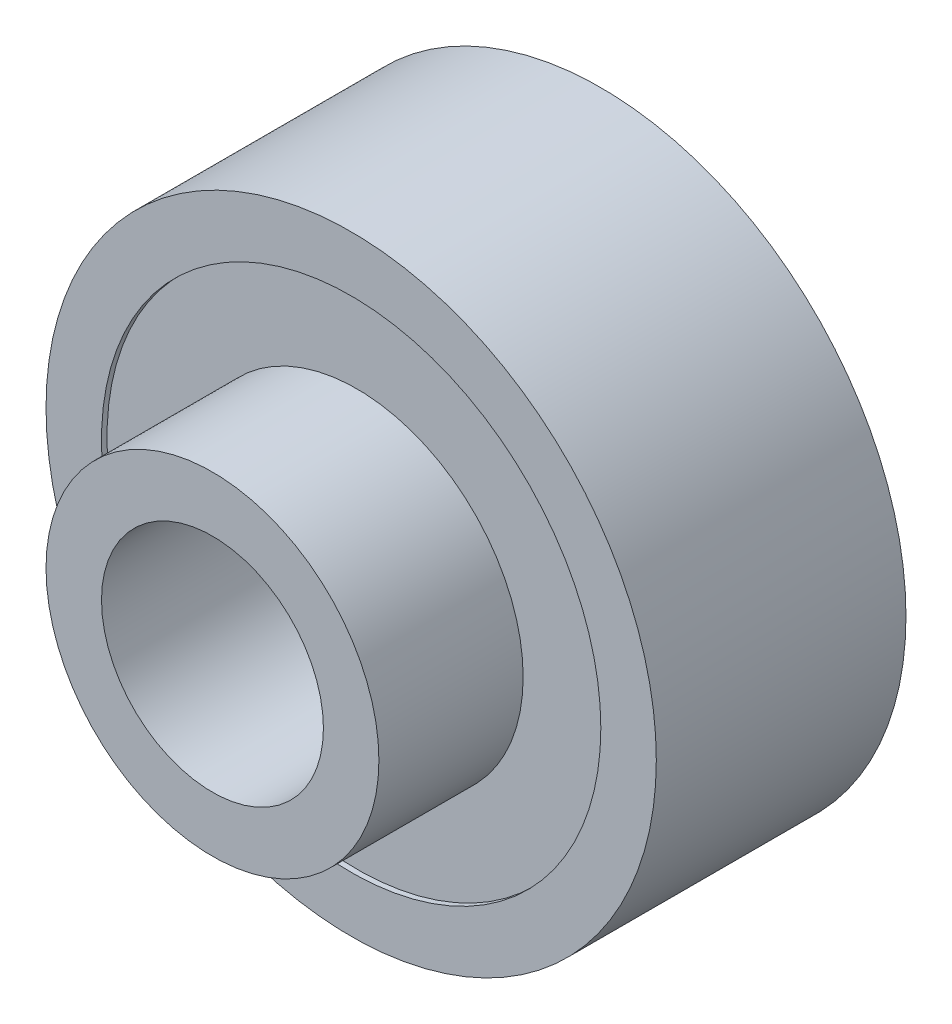
ISO-10303-21;
HEADER;
FILE_DESCRIPTION(('STEP AP214'),'2;1');
FILE_NAME('part.step','',(''),(''),'','','');
FILE_SCHEMA(('AUTOMOTIVE_DESIGN { 1 0 10303 214 1 1 1 1 }'));
ENDSEC;
DATA;
#1=APPLICATION_CONTEXT('core data for automotive mechanical design processes');
#2=APPLICATION_PROTOCOL_DEFINITION('international standard','automotive_design',2000,#1);
#3=PRODUCT_CONTEXT('',#1,'mechanical');
#4=PRODUCT('Part','Part','',(#3));
#5=PRODUCT_RELATED_PRODUCT_CATEGORY('part','',(#4));
#6=PRODUCT_DEFINITION_FORMATION('','',#4);
#7=PRODUCT_DEFINITION_CONTEXT('part definition',#1,'design');
#8=PRODUCT_DEFINITION('design','',#6,#7);
#9=PRODUCT_DEFINITION_SHAPE('','',#8);
#10=(LENGTH_UNIT() NAMED_UNIT(*) SI_UNIT(.MILLI.,.METRE.));
#11=(NAMED_UNIT(*) PLANE_ANGLE_UNIT() SI_UNIT($,.RADIAN.));
#12=(NAMED_UNIT(*) SI_UNIT($,.STERADIAN.) SOLID_ANGLE_UNIT());
#13=UNCERTAINTY_MEASURE_WITH_UNIT(LENGTH_MEASURE(1.E-05),#10,'distance_accuracy_value','');
#14=(GEOMETRIC_REPRESENTATION_CONTEXT(3) GLOBAL_UNCERTAINTY_ASSIGNED_CONTEXT((#13)) GLOBAL_UNIT_ASSIGNED_CONTEXT((#10,
#11,#12)) REPRESENTATION_CONTEXT('',''));
#15=CARTESIAN_POINT('',(0.,0.,0.));
#16=DIRECTION('',(0.,0.,1.));
#17=DIRECTION('',(1.,0.,0.));
#18=AXIS2_PLACEMENT_3D('',#15,#16,#17);
#19=CARTESIAN_POINT('',(0.,0.,0.));
#20=DIRECTION('',(0.,0.,1.));
#21=DIRECTION('',(1.,0.,0.));
#22=AXIS2_PLACEMENT_3D('',#19,#20,#21);
#23=PLANE('',#22);
#24=CARTESIAN_POINT('',(0.,0.,0.));
#25=DIRECTION('',(0.,0.,1.));
#26=DIRECTION('',(1.,0.,0.));
#27=AXIS2_PLACEMENT_3D('',#24,#25,#26);
#28=CIRCLE('',#27,4.);
#29=CARTESIAN_POINT('',(4.,0.,0.));
#30=VERTEX_POINT('',#29);
#31=EDGE_CURVE('E46',#30,#30,#28,.T.);
#32=ORIENTED_EDGE('',*,*,#31,.T.);
#33=EDGE_LOOP('',(#32));
#34=FACE_BOUND('',#33,.T.);
#35=CARTESIAN_POINT('',(0.,0.,0.));
#36=DIRECTION('',(0.,0.,-1.));
#37=DIRECTION('',(-1.,0.,0.));
#38=AXIS2_PLACEMENT_3D('',#35,#36,#37);
#39=CIRCLE('',#38,6.);
#40=CARTESIAN_POINT('',(-6.,0.,0.));
#41=VERTEX_POINT('',#40);
#42=EDGE_CURVE('E66',#41,#41,#39,.T.);
#43=ORIENTED_EDGE('',*,*,#42,.T.);
#44=EDGE_LOOP('',(#43));
#45=FACE_BOUND('',#44,.T.);
#46=ADVANCED_FACE('F35',(#34,#45),#23,.F.);
#47=CARTESIAN_POINT('',(0.,0.,9.));
#48=DIRECTION('',(0.,0.,-1.));
#49=DIRECTION('',(-1.,0.,0.));
#50=AXIS2_PLACEMENT_3D('',#47,#48,#49);
#51=CYLINDRICAL_SURFACE('',#50,11.);
#52=CARTESIAN_POINT('',(0.,0.,9.));
#53=DIRECTION('',(0.,0.,1.));
#54=DIRECTION('',(1.,0.,0.));
#55=AXIS2_PLACEMENT_3D('',#52,#53,#54);
#56=CIRCLE('',#55,11.);
#57=CARTESIAN_POINT('',(11.,0.,9.));
#58=VERTEX_POINT('',#57);
#59=EDGE_CURVE('E10',#58,#58,#56,.T.);
#60=ORIENTED_EDGE('',*,*,#59,.F.);
#61=EDGE_LOOP('',(#60));
#62=FACE_BOUND('',#61,.T.);
#63=CARTESIAN_POINT('',(0.,0.,0.));
#64=DIRECTION('',(0.,0.,1.));
#65=DIRECTION('',(1.,0.,0.));
#66=AXIS2_PLACEMENT_3D('',#63,#64,#65);
#67=CIRCLE('',#66,11.);
#68=CARTESIAN_POINT('',(11.,0.,0.));
#69=VERTEX_POINT('',#68);
#70=EDGE_CURVE('E39',#69,#69,#67,.T.);
#71=ORIENTED_EDGE('',*,*,#70,.T.);
#72=EDGE_LOOP('',(#71));
#73=FACE_BOUND('',#72,.T.);
#74=ADVANCED_FACE('F37',(#62,#73),#51,.T.);
#75=CARTESIAN_POINT('',(0.,0.,9.));
#76=DIRECTION('',(0.,0.,1.));
#77=DIRECTION('',(1.,0.,0.));
#78=AXIS2_PLACEMENT_3D('',#75,#76,#77);
#79=PLANE('',#78);
#80=CARTESIAN_POINT('',(0.,0.,9.));
#81=DIRECTION('',(0.,0.,1.));
#82=DIRECTION('',(1.,0.,0.));
#83=AXIS2_PLACEMENT_3D('',#80,#81,#82);
#84=CIRCLE('',#83,9.);
#85=CARTESIAN_POINT('',(9.,0.,9.));
#86=VERTEX_POINT('',#85);
#87=EDGE_CURVE('E51',#86,#86,#84,.T.);
#88=ORIENTED_EDGE('',*,*,#87,.F.);
#89=EDGE_LOOP('',(#88));
#90=FACE_BOUND('',#89,.T.);
#91=ORIENTED_EDGE('',*,*,#59,.T.);
#92=EDGE_LOOP('',(#91));
#93=FACE_BOUND('',#92,.T.);
#94=ADVANCED_FACE('F97',(#90,#93),#79,.T.);
#95=CARTESIAN_POINT('',(0.,0.,0.));
#96=DIRECTION('',(0.,0.,-1.));
#97=DIRECTION('',(-1.,0.,0.));
#98=AXIS2_PLACEMENT_3D('',#95,#96,#97);
#99=CIRCLE('',#98,9.);
#100=CARTESIAN_POINT('',(-9.,0.,0.));
#101=VERTEX_POINT('',#100);
#102=EDGE_CURVE('E60',#101,#101,#99,.T.);
#103=ORIENTED_EDGE('',*,*,#102,.F.);
#104=EDGE_LOOP('',(#103));
#105=FACE_BOUND('',#104,.T.);
#106=ORIENTED_EDGE('',*,*,#70,.F.);
#107=EDGE_LOOP('',(#106));
#108=FACE_BOUND('',#107,.T.);
#109=ADVANCED_FACE('F93',(#105,#108),#23,.F.);
#110=CARTESIAN_POINT('',(0.,0.,0.));
#111=DIRECTION('',(0.,0.,1.));
#112=DIRECTION('',(1.,0.,0.));
#113=AXIS2_PLACEMENT_3D('',#110,#111,#112);
#114=CYLINDRICAL_SURFACE('',#113,4.);
#115=ORIENTED_EDGE('',*,*,#31,.F.);
#116=EDGE_LOOP('',(#115));
#117=FACE_BOUND('',#116,.T.);
#118=CARTESIAN_POINT('',(0.,0.,14.));
#119=DIRECTION('',(0.,0.,1.));
#120=DIRECTION('',(1.,0.,0.));
#121=AXIS2_PLACEMENT_3D('',#118,#119,#120);
#122=CIRCLE('',#121,4.);
#123=CARTESIAN_POINT('',(4.,0.,14.));
#124=VERTEX_POINT('',#123);
#125=EDGE_CURVE('E74',#124,#124,#122,.T.);
#126=ORIENTED_EDGE('',*,*,#125,.T.);
#127=EDGE_LOOP('',(#126));
#128=FACE_BOUND('',#127,.T.);
#129=ADVANCED_FACE('F78',(#117,#128),#114,.F.);
#130=CARTESIAN_POINT('',(0.,0.,8.8));
#131=DIRECTION('',(0.,0.,1.));
#132=DIRECTION('',(1.,0.,0.));
#133=AXIS2_PLACEMENT_3D('',#130,#131,#132);
#134=CYLINDRICAL_SURFACE('',#133,9.);
#135=CARTESIAN_POINT('',(0.,0.,8.8));
#136=DIRECTION('',(0.,0.,1.));
#137=DIRECTION('',(1.,0.,0.));
#138=AXIS2_PLACEMENT_3D('',#135,#136,#137);
#139=CIRCLE('',#138,9.);
#140=CARTESIAN_POINT('',(9.,0.,8.8));
#141=VERTEX_POINT('',#140);
#142=EDGE_CURVE('E50',#141,#141,#139,.T.);
#143=ORIENTED_EDGE('',*,*,#142,.F.);
#144=EDGE_LOOP('',(#143));
#145=FACE_BOUND('',#144,.T.);
#146=ORIENTED_EDGE('',*,*,#87,.T.);
#147=EDGE_LOOP('',(#146));
#148=FACE_BOUND('',#147,.T.);
#149=ADVANCED_FACE('F107',(#145,#148),#134,.F.);
#150=CARTESIAN_POINT('',(0.,0.,8.8));
#151=DIRECTION('',(0.,0.,1.));
#152=DIRECTION('',(1.,0.,0.));
#153=AXIS2_PLACEMENT_3D('',#150,#151,#152);
#154=PLANE('',#153);
#155=CARTESIAN_POINT('',(0.,0.,8.8));
#156=DIRECTION('',(0.,0.,1.));
#157=DIRECTION('',(1.,0.,0.));
#158=AXIS2_PLACEMENT_3D('',#155,#156,#157);
#159=CIRCLE('',#158,6.);
#160=CARTESIAN_POINT('',(6.,0.,8.8));
#161=VERTEX_POINT('',#160);
#162=EDGE_CURVE('E54',#161,#161,#159,.T.);
#163=ORIENTED_EDGE('',*,*,#162,.F.);
#164=EDGE_LOOP('',(#163));
#165=FACE_BOUND('',#164,.T.);
#166=ORIENTED_EDGE('',*,*,#142,.T.);
#167=EDGE_LOOP('',(#166));
#168=FACE_BOUND('',#167,.T.);
#169=ADVANCED_FACE('F127',(#165,#168),#154,.T.);
#170=CARTESIAN_POINT('',(0.,0.,8.8));
#171=DIRECTION('',(0.,0.,1.));
#172=DIRECTION('',(1.,0.,0.));
#173=AXIS2_PLACEMENT_3D('',#170,#171,#172);
#174=CYLINDRICAL_SURFACE('',#173,6.);
#175=ORIENTED_EDGE('',*,*,#162,.T.);
#176=EDGE_LOOP('',(#175));
#177=FACE_BOUND('',#176,.T.);
#178=CARTESIAN_POINT('',(0.,0.,14.));
#179=DIRECTION('',(0.,0.,1.));
#180=DIRECTION('',(1.,0.,0.));
#181=AXIS2_PLACEMENT_3D('',#178,#179,#180);
#182=CIRCLE('',#181,6.);
#183=CARTESIAN_POINT('',(6.,0.,14.));
#184=VERTEX_POINT('',#183);
#185=EDGE_CURVE('E69',#184,#184,#182,.T.);
#186=ORIENTED_EDGE('',*,*,#185,.F.);
#187=EDGE_LOOP('',(#186));
#188=FACE_BOUND('',#187,.T.);
#189=ADVANCED_FACE('F118',(#177,#188),#174,.T.);
#190=CARTESIAN_POINT('',(0.,0.,0.2));
#191=DIRECTION('',(0.,0.,-1.));
#192=DIRECTION('',(-1.,0.,0.));
#193=AXIS2_PLACEMENT_3D('',#190,#191,#192);
#194=CYLINDRICAL_SURFACE('',#193,9.);
#195=CARTESIAN_POINT('',(0.,0.,0.2));
#196=DIRECTION('',(0.,0.,-1.));
#197=DIRECTION('',(-1.,0.,0.));
#198=AXIS2_PLACEMENT_3D('',#195,#196,#197);
#199=CIRCLE('',#198,9.);
#200=CARTESIAN_POINT('',(-9.,0.,0.2));
#201=VERTEX_POINT('',#200);
#202=EDGE_CURVE('E59',#201,#201,#199,.T.);
#203=ORIENTED_EDGE('',*,*,#202,.F.);
#204=EDGE_LOOP('',(#203));
#205=FACE_BOUND('',#204,.T.);
#206=ORIENTED_EDGE('',*,*,#102,.T.);
#207=EDGE_LOOP('',(#206));
#208=FACE_BOUND('',#207,.T.);
#209=ADVANCED_FACE('F116',(#205,#208),#194,.F.);
#210=CARTESIAN_POINT('',(0.,0.,0.2));
#211=DIRECTION('',(0.,0.,-1.));
#212=DIRECTION('',(-1.,0.,0.));
#213=AXIS2_PLACEMENT_3D('',#210,#211,#212);
#214=PLANE('',#213);
#215=CARTESIAN_POINT('',(0.,0.,0.2));
#216=DIRECTION('',(0.,0.,-1.));
#217=DIRECTION('',(-1.,0.,0.));
#218=AXIS2_PLACEMENT_3D('',#215,#216,#217);
#219=CIRCLE('',#218,6.);
#220=CARTESIAN_POINT('',(-6.,0.,0.2));
#221=VERTEX_POINT('',#220);
#222=EDGE_CURVE('E63',#221,#221,#219,.T.);
#223=ORIENTED_EDGE('',*,*,#222,.F.);
#224=EDGE_LOOP('',(#223));
#225=FACE_BOUND('',#224,.T.);
#226=ORIENTED_EDGE('',*,*,#202,.T.);
#227=EDGE_LOOP('',(#226));
#228=FACE_BOUND('',#227,.T.);
#229=ADVANCED_FACE('F88',(#225,#228),#214,.T.);
#230=CARTESIAN_POINT('',(0.,0.,0.2));
#231=DIRECTION('',(0.,0.,-1.));
#232=DIRECTION('',(-1.,0.,0.));
#233=AXIS2_PLACEMENT_3D('',#230,#231,#232);
#234=CYLINDRICAL_SURFACE('',#233,6.);
#235=ORIENTED_EDGE('',*,*,#222,.T.);
#236=EDGE_LOOP('',(#235));
#237=FACE_BOUND('',#236,.T.);
#238=ORIENTED_EDGE('',*,*,#42,.F.);
#239=EDGE_LOOP('',(#238));
#240=FACE_BOUND('',#239,.T.);
#241=ADVANCED_FACE('F82',(#237,#240),#234,.T.);
#242=CARTESIAN_POINT('',(0.,0.,14.));
#243=DIRECTION('',(0.,0.,1.));
#244=DIRECTION('',(1.,0.,0.));
#245=AXIS2_PLACEMENT_3D('',#242,#243,#244);
#246=PLANE('',#245);
#247=ORIENTED_EDGE('',*,*,#185,.T.);
#248=EDGE_LOOP('',(#247));
#249=FACE_BOUND('',#248,.T.);
#250=ORIENTED_EDGE('',*,*,#125,.F.);
#251=EDGE_LOOP('',(#250));
#252=FACE_BOUND('',#251,.T.);
#253=ADVANCED_FACE('F80',(#249,#252),#246,.T.);
#254=CLOSED_SHELL('',(#46,#74,#94,#109,#129,#149,#169,#189,#209,#229,#241,#253));
#255=MANIFOLD_SOLID_BREP('B2',#254);
#256=ADVANCED_BREP_SHAPE_REPRESENTATION('',(#18,#255),#14);
#257=SHAPE_DEFINITION_REPRESENTATION(#9,#256);
ENDSEC;
END-ISO-10303-21;
